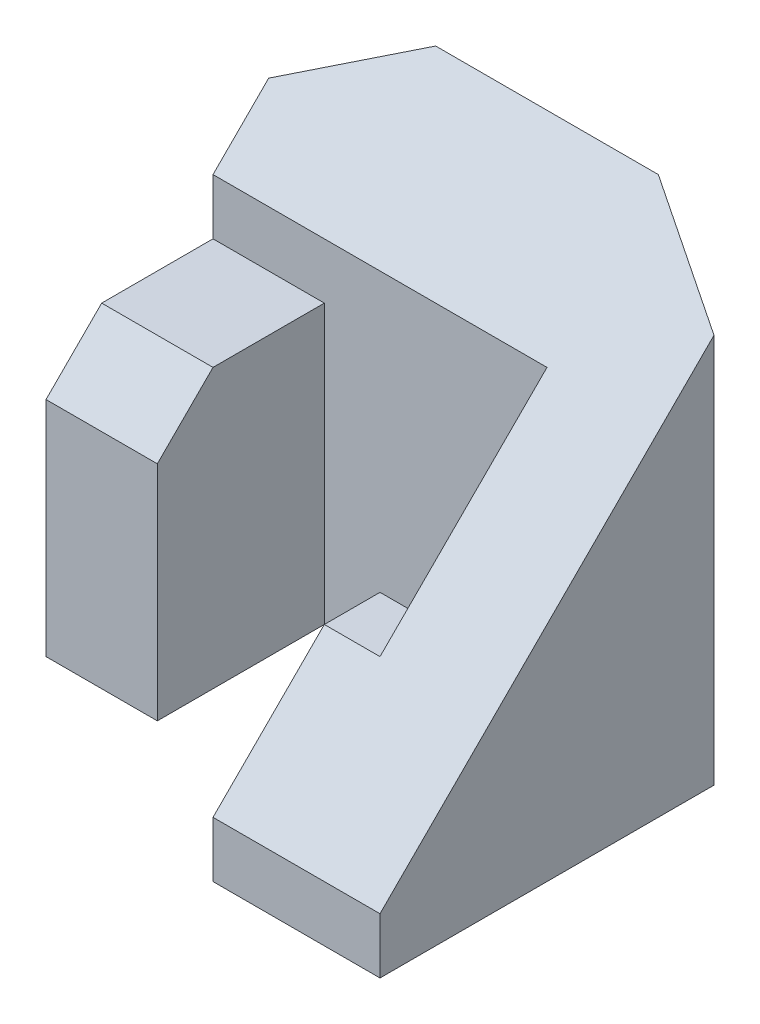
ISO-10303-21;
HEADER;
FILE_DESCRIPTION(('STEP AP214'),'2;1');
FILE_NAME('part.step','',(''),(''),'','','');
FILE_SCHEMA(('AUTOMOTIVE_DESIGN { 1 0 10303 214 1 1 1 1 }'));
ENDSEC;
DATA;
#1=APPLICATION_CONTEXT('core data for automotive mechanical design processes');
#2=APPLICATION_PROTOCOL_DEFINITION('international standard','automotive_design',2000,#1);
#3=PRODUCT_CONTEXT('',#1,'mechanical');
#4=PRODUCT('Part','Part','',(#3));
#5=PRODUCT_RELATED_PRODUCT_CATEGORY('part','',(#4));
#6=PRODUCT_DEFINITION_FORMATION('','',#4);
#7=PRODUCT_DEFINITION_CONTEXT('part definition',#1,'design');
#8=PRODUCT_DEFINITION('design','',#6,#7);
#9=PRODUCT_DEFINITION_SHAPE('','',#8);
#10=(LENGTH_UNIT() NAMED_UNIT(*) SI_UNIT(.MILLI.,.METRE.));
#11=(NAMED_UNIT(*) PLANE_ANGLE_UNIT() SI_UNIT($,.RADIAN.));
#12=(NAMED_UNIT(*) SI_UNIT($,.STERADIAN.) SOLID_ANGLE_UNIT());
#13=UNCERTAINTY_MEASURE_WITH_UNIT(LENGTH_MEASURE(1.E-05),#10,'distance_accuracy_value','');
#14=(GEOMETRIC_REPRESENTATION_CONTEXT(3) GLOBAL_UNCERTAINTY_ASSIGNED_CONTEXT((#13)) GLOBAL_UNIT_ASSIGNED_CONTEXT((#10,
#11,#12)) REPRESENTATION_CONTEXT('',''));
#15=CARTESIAN_POINT('',(0.,0.,0.));
#16=DIRECTION('',(0.,0.,1.));
#17=DIRECTION('',(1.,0.,0.));
#18=AXIS2_PLACEMENT_3D('',#15,#16,#17);
#19=CARTESIAN_POINT('',(-20.,-20.,10.));
#20=DIRECTION('',(0.,0.,-1.));
#21=DIRECTION('',(-1.,0.,0.));
#22=AXIS2_PLACEMENT_3D('',#19,#20,#21);
#23=PLANE('',#22);
#24=DIRECTION('',(0.,1.,0.));
#25=VECTOR('',#24,1.);
#26=CARTESIAN_POINT('',(-9.99999999999999,-20.,10.));
#27=LINE('',#26,#25);
#28=CARTESIAN_POINT('',(-9.99999999999999,-20.,10.));
#29=VERTEX_POINT('',#28);
#30=CARTESIAN_POINT('',(-9.99999999999999,4.99999999999999,10.));
#31=VERTEX_POINT('',#30);
#32=EDGE_CURVE('E239',#29,#31,#27,.T.);
#33=ORIENTED_EDGE('',*,*,#32,.F.);
#34=DIRECTION('',(-1.,0.,0.));
#35=VECTOR('',#34,1.);
#36=CARTESIAN_POINT('',(-20.,-20.,10.));
#37=LINE('',#36,#35);
#38=CARTESIAN_POINT('',(10.,-20.,10.));
#39=VERTEX_POINT('',#38);
#40=EDGE_CURVE('E209',#39,#29,#37,.T.);
#41=ORIENTED_EDGE('',*,*,#40,.F.);
#42=DIRECTION('',(0.,1.,0.));
#43=VECTOR('',#42,1.);
#44=CARTESIAN_POINT('',(10.,-20.,10.));
#45=LINE('',#44,#43);
#46=CARTESIAN_POINT('',(10.,9.99999999999999,10.));
#47=VERTEX_POINT('',#46);
#48=EDGE_CURVE('E158',#39,#47,#45,.T.);
#49=ORIENTED_EDGE('',*,*,#48,.T.);
#50=DIRECTION('',(1.,0.,0.));
#51=VECTOR('',#50,1.);
#52=CARTESIAN_POINT('',(-20.,9.99999999999999,10.));
#53=LINE('',#52,#51);
#54=CARTESIAN_POINT('',(-20.,9.99999999999999,10.));
#55=VERTEX_POINT('',#54);
#56=EDGE_CURVE('E198',#55,#47,#53,.T.);
#57=ORIENTED_EDGE('',*,*,#56,.F.);
#58=DIRECTION('',(0.,1.,0.));
#59=VECTOR('',#58,1.);
#60=CARTESIAN_POINT('',(-20.,-20.,10.));
#61=LINE('',#60,#59);
#62=CARTESIAN_POINT('',(-20.,4.99999999999999,10.));
#63=VERTEX_POINT('',#62);
#64=EDGE_CURVE('E154',#63,#55,#61,.T.);
#65=ORIENTED_EDGE('',*,*,#64,.F.);
#66=DIRECTION('',(-1.,0.,0.));
#67=VECTOR('',#66,1.);
#68=CARTESIAN_POINT('',(-9.99999999999999,4.99999999999999,10.));
#69=LINE('',#68,#67);
#70=EDGE_CURVE('E243',#31,#63,#69,.T.);
#71=ORIENTED_EDGE('',*,*,#70,.F.);
#72=EDGE_LOOP('',(#33,#41,#49,#57,#65,#71));
#73=FACE_BOUND('',#72,.T.);
#74=ADVANCED_FACE('F32',(#73),#23,.F.);
#75=CARTESIAN_POINT('',(20.,20.,35.));
#76=DIRECTION('',(-1.,0.,0.));
#77=DIRECTION('',(0.,0.,1.));
#78=AXIS2_PLACEMENT_3D('',#75,#76,#77);
#79=PLANE('',#78);
#80=DIRECTION('',(0.,0.,-1.));
#81=VECTOR('',#80,1.);
#82=CARTESIAN_POINT('',(20.,-20.,35.));
#83=LINE('',#82,#81);
#84=CARTESIAN_POINT('',(20.,-20.,35.));
#85=VERTEX_POINT('',#84);
#86=CARTESIAN_POINT('',(20.,-20.,5.));
#87=VERTEX_POINT('',#86);
#88=EDGE_CURVE('E164',#85,#87,#83,.T.);
#89=ORIENTED_EDGE('',*,*,#88,.T.);
#90=DIRECTION('',(0.,-1.,0.));
#91=VECTOR('',#90,1.);
#92=CARTESIAN_POINT('',(20.,20.,5.));
#93=LINE('',#92,#91);
#94=CARTESIAN_POINT('',(20.,15.,5.));
#95=VERTEX_POINT('',#94);
#96=EDGE_CURVE('E175',#95,#87,#93,.T.);
#97=ORIENTED_EDGE('',*,*,#96,.F.);
#98=DIRECTION('',(0.,0.707106781186548,-0.707106781186548));
#99=VECTOR('',#98,1.);
#100=CARTESIAN_POINT('',(20.,20.,0.));
#101=LINE('',#100,#99);
#102=CARTESIAN_POINT('',(20.,-15.,35.));
#103=VERTEX_POINT('',#102);
#104=EDGE_CURVE('E180',#103,#95,#101,.T.);
#105=ORIENTED_EDGE('',*,*,#104,.F.);
#106=DIRECTION('',(0.,1.,0.));
#107=VECTOR('',#106,1.);
#108=CARTESIAN_POINT('',(20.,20.,35.));
#109=LINE('',#108,#107);
#110=EDGE_CURVE('E156',#85,#103,#109,.T.);
#111=ORIENTED_EDGE('',*,*,#110,.F.);
#112=EDGE_LOOP('',(#89,#97,#105,#111));
#113=FACE_BOUND('',#112,.T.);
#114=ADVANCED_FACE('F34',(#113),#79,.F.);
#115=CARTESIAN_POINT('',(-20.,20.,35.));
#116=DIRECTION('',(1.,0.,0.));
#117=DIRECTION('',(0.,0.,-1.));
#118=AXIS2_PLACEMENT_3D('',#115,#116,#117);
#119=PLANE('',#118);
#120=DIRECTION('',(0.,0.707106781186548,-0.707106781186548));
#121=VECTOR('',#120,1.);
#122=CARTESIAN_POINT('',(-20.,20.,0.));
#123=LINE('',#122,#121);
#124=CARTESIAN_POINT('',(-20.,15.,4.99999999999999));
#125=VERTEX_POINT('',#124);
#126=EDGE_CURVE('E187',#55,#125,#123,.T.);
#127=ORIENTED_EDGE('',*,*,#126,.T.);
#128=DIRECTION('',(0.,-1.,0.));
#129=VECTOR('',#128,1.);
#130=CARTESIAN_POINT('',(-20.,20.,5.));
#131=LINE('',#130,#129);
#132=CARTESIAN_POINT('',(-20.,-20.,5.));
#133=VERTEX_POINT('',#132);
#134=EDGE_CURVE('E46',#125,#133,#131,.T.);
#135=ORIENTED_EDGE('',*,*,#134,.T.);
#136=DIRECTION('',(0.,0.,-1.));
#137=VECTOR('',#136,1.);
#138=CARTESIAN_POINT('',(-20.,-20.,35.));
#139=LINE('',#138,#137);
#140=CARTESIAN_POINT('',(-20.,-20.,25.));
#141=VERTEX_POINT('',#140);
#142=EDGE_CURVE('E167',#141,#133,#139,.T.);
#143=ORIENTED_EDGE('',*,*,#142,.F.);
#144=DIRECTION('',(0.,-1.,0.));
#145=VECTOR('',#144,1.);
#146=CARTESIAN_POINT('',(-20.,4.99999999999999,25.));
#147=LINE('',#146,#145);
#148=CARTESIAN_POINT('',(-20.,0.,25.));
#149=VERTEX_POINT('',#148);
#150=EDGE_CURVE('E240',#149,#141,#147,.T.);
#151=ORIENTED_EDGE('',*,*,#150,.F.);
#152=DIRECTION('',(0.,-0.707106781186547,0.707106781186548));
#153=VECTOR('',#152,1.);
#154=CARTESIAN_POINT('',(-20.,4.99999999999999,20.));
#155=LINE('',#154,#153);
#156=CARTESIAN_POINT('',(-20.,4.99999999999999,20.));
#157=VERTEX_POINT('',#156);
#158=EDGE_CURVE('E231',#157,#149,#155,.T.);
#159=ORIENTED_EDGE('',*,*,#158,.F.);
#160=DIRECTION('',(0.,0.,-1.));
#161=VECTOR('',#160,1.);
#162=CARTESIAN_POINT('',(-20.,4.99999999999999,25.));
#163=LINE('',#162,#161);
#164=EDGE_CURVE('E248',#157,#63,#163,.T.);
#165=ORIENTED_EDGE('',*,*,#164,.T.);
#166=ORIENTED_EDGE('',*,*,#64,.T.);
#167=EDGE_LOOP('',(#127,#135,#143,#151,#159,#165,#166));
#168=FACE_BOUND('',#167,.T.);
#169=ADVANCED_FACE('F297',(#168),#119,.F.);
#170=CARTESIAN_POINT('',(0.,0.,35.));
#171=DIRECTION('',(0.,0.,1.));
#172=DIRECTION('',(1.,0.,0.));
#173=AXIS2_PLACEMENT_3D('',#170,#171,#172);
#174=PLANE('',#173);
#175=ORIENTED_EDGE('',*,*,#110,.T.);
#176=DIRECTION('',(-1.,0.,0.));
#177=VECTOR('',#176,1.);
#178=CARTESIAN_POINT('',(20.,-15.,35.));
#179=LINE('',#178,#177);
#180=CARTESIAN_POINT('',(5.00000000000001,-15.,35.));
#181=VERTEX_POINT('',#180);
#182=EDGE_CURVE('E186',#103,#181,#179,.T.);
#183=ORIENTED_EDGE('',*,*,#182,.T.);
#184=DIRECTION('',(0.,1.,0.));
#185=VECTOR('',#184,1.);
#186=CARTESIAN_POINT('',(5.00000000000001,-20.,35.));
#187=LINE('',#186,#185);
#188=CARTESIAN_POINT('',(5.00000000000001,-20.,35.));
#189=VERTEX_POINT('',#188);
#190=EDGE_CURVE('E211',#189,#181,#187,.T.);
#191=ORIENTED_EDGE('',*,*,#190,.F.);
#192=DIRECTION('',(1.,0.,0.));
#193=VECTOR('',#192,1.);
#194=CARTESIAN_POINT('',(-20.,-20.,35.));
#195=LINE('',#194,#193);
#196=EDGE_CURVE('E161',#189,#85,#195,.T.);
#197=ORIENTED_EDGE('',*,*,#196,.T.);
#198=EDGE_LOOP('',(#175,#183,#191,#197));
#199=FACE_BOUND('',#198,.T.);
#200=ADVANCED_FACE('F225',(#199),#174,.T.);
#201=CARTESIAN_POINT('',(10.,-20.,10.));
#202=DIRECTION('',(1.,0.,0.));
#203=DIRECTION('',(0.,0.,-1.));
#204=AXIS2_PLACEMENT_3D('',#201,#202,#203);
#205=PLANE('',#204);
#206=DIRECTION('',(0.,-0.707106781186548,0.707106781186548));
#207=VECTOR('',#206,1.);
#208=CARTESIAN_POINT('',(10.,-5.,25.));
#209=LINE('',#208,#207);
#210=CARTESIAN_POINT('',(10.,-5.00000000000001,25.));
#211=VERTEX_POINT('',#210);
#212=EDGE_CURVE('E189',#47,#211,#209,.T.);
#213=ORIENTED_EDGE('',*,*,#212,.F.);
#214=ORIENTED_EDGE('',*,*,#48,.F.);
#215=DIRECTION('',(0.,0.,-1.));
#216=VECTOR('',#215,1.);
#217=CARTESIAN_POINT('',(10.,-20.,10.));
#218=LINE('',#217,#216);
#219=CARTESIAN_POINT('',(10.,-20.,20.));
#220=VERTEX_POINT('',#219);
#221=EDGE_CURVE('E206',#220,#39,#218,.T.);
#222=ORIENTED_EDGE('',*,*,#221,.F.);
#223=DIRECTION('',(0.,1.,0.));
#224=VECTOR('',#223,1.);
#225=CARTESIAN_POINT('',(10.,-20.,20.));
#226=LINE('',#225,#224);
#227=CARTESIAN_POINT('',(10.,-5.00000000000001,20.));
#228=VERTEX_POINT('',#227);
#229=EDGE_CURVE('E215',#220,#228,#226,.T.);
#230=ORIENTED_EDGE('',*,*,#229,.T.);
#231=DIRECTION('',(0.,0.,1.));
#232=VECTOR('',#231,1.);
#233=CARTESIAN_POINT('',(10.,-5.00000000000001,20.));
#234=LINE('',#233,#232);
#235=EDGE_CURVE('E259',#228,#211,#234,.T.);
#236=ORIENTED_EDGE('',*,*,#235,.T.);
#237=EDGE_LOOP('',(#213,#214,#222,#230,#236));
#238=FACE_BOUND('',#237,.T.);
#239=ADVANCED_FACE('F279',(#238),#205,.F.);
#240=CARTESIAN_POINT('',(10.,-20.,20.));
#241=DIRECTION('',(0.,0.,1.));
#242=DIRECTION('',(1.,0.,0.));
#243=AXIS2_PLACEMENT_3D('',#240,#241,#242);
#244=PLANE('',#243);
#245=DIRECTION('',(0.,1.,0.));
#246=VECTOR('',#245,1.);
#247=CARTESIAN_POINT('',(5.00000000000001,-20.,20.));
#248=LINE('',#247,#246);
#249=CARTESIAN_POINT('',(5.00000000000001,-20.,20.));
#250=VERTEX_POINT('',#249);
#251=CARTESIAN_POINT('',(5.00000000000001,-5.00000000000001,20.));
#252=VERTEX_POINT('',#251);
#253=EDGE_CURVE('E218',#250,#252,#248,.T.);
#254=ORIENTED_EDGE('',*,*,#253,.T.);
#255=DIRECTION('',(-1.,0.,0.));
#256=VECTOR('',#255,1.);
#257=CARTESIAN_POINT('',(10.,-5.00000000000001,20.));
#258=LINE('',#257,#256);
#259=EDGE_CURVE('E194',#228,#252,#258,.T.);
#260=ORIENTED_EDGE('',*,*,#259,.F.);
#261=ORIENTED_EDGE('',*,*,#229,.F.);
#262=DIRECTION('',(1.,0.,0.));
#263=VECTOR('',#262,1.);
#264=CARTESIAN_POINT('',(10.,-20.,20.));
#265=LINE('',#264,#263);
#266=EDGE_CURVE('E203',#250,#220,#265,.T.);
#267=ORIENTED_EDGE('',*,*,#266,.F.);
#268=EDGE_LOOP('',(#254,#260,#261,#267));
#269=FACE_BOUND('',#268,.T.);
#270=ADVANCED_FACE('F273',(#269),#244,.F.);
#271=CARTESIAN_POINT('',(5.00000000000001,-20.,20.));
#272=DIRECTION('',(1.,0.,0.));
#273=DIRECTION('',(0.,0.,-1.));
#274=AXIS2_PLACEMENT_3D('',#271,#272,#273);
#275=PLANE('',#274);
#276=DIRECTION('',(0.,-0.707106781186548,0.707106781186548));
#277=VECTOR('',#276,1.);
#278=CARTESIAN_POINT('',(5.00000000000001,-10.,30.));
#279=LINE('',#278,#277);
#280=CARTESIAN_POINT('',(5.00000000000001,-5.00000000000001,25.));
#281=VERTEX_POINT('',#280);
#282=EDGE_CURVE('E170',#281,#181,#279,.T.);
#283=ORIENTED_EDGE('',*,*,#282,.F.);
#284=DIRECTION('',(0.,0.,1.));
#285=VECTOR('',#284,1.);
#286=CARTESIAN_POINT('',(5.00000000000001,-5.00000000000001,20.));
#287=LINE('',#286,#285);
#288=EDGE_CURVE('E258',#252,#281,#287,.T.);
#289=ORIENTED_EDGE('',*,*,#288,.F.);
#290=ORIENTED_EDGE('',*,*,#253,.F.);
#291=DIRECTION('',(0.,0.,-1.));
#292=VECTOR('',#291,1.);
#293=CARTESIAN_POINT('',(5.00000000000001,-20.,20.));
#294=LINE('',#293,#292);
#295=EDGE_CURVE('E200',#189,#250,#294,.T.);
#296=ORIENTED_EDGE('',*,*,#295,.F.);
#297=ORIENTED_EDGE('',*,*,#190,.T.);
#298=EDGE_LOOP('',(#283,#289,#290,#296,#297));
#299=FACE_BOUND('',#298,.T.);
#300=ADVANCED_FACE('F271',(#299),#275,.F.);
#301=CARTESIAN_POINT('',(-20.,-20.,35.));
#302=DIRECTION('',(0.,1.,0.));
#303=DIRECTION('',(0.,0.,1.));
#304=AXIS2_PLACEMENT_3D('',#301,#302,#303);
#305=PLANE('',#304);
#306=ORIENTED_EDGE('',*,*,#142,.T.);
#307=DIRECTION('',(-0.894427190999916,0.,0.447213595499958));
#308=VECTOR('',#307,1.);
#309=CARTESIAN_POINT('',(-9.99999999999999,-20.,0.));
#310=LINE('',#309,#308);
#311=CARTESIAN_POINT('',(-9.99999999999999,-20.,0.));
#312=VERTEX_POINT('',#311);
#313=EDGE_CURVE('E150',#312,#133,#310,.T.);
#314=ORIENTED_EDGE('',*,*,#313,.F.);
#315=DIRECTION('',(1.,0.,0.));
#316=VECTOR('',#315,1.);
#317=CARTESIAN_POINT('',(-20.,-20.,0.));
#318=LINE('',#317,#316);
#319=CARTESIAN_POINT('',(10.,-20.,0.));
#320=VERTEX_POINT('',#319);
#321=EDGE_CURVE('E149',#312,#320,#318,.T.);
#322=ORIENTED_EDGE('',*,*,#321,.T.);
#323=DIRECTION('',(-0.894427190999916,0.,-0.447213595499958));
#324=VECTOR('',#323,1.);
#325=CARTESIAN_POINT('',(10.,-20.,0.));
#326=LINE('',#325,#324);
#327=EDGE_CURVE('E183',#87,#320,#326,.T.);
#328=ORIENTED_EDGE('',*,*,#327,.F.);
#329=ORIENTED_EDGE('',*,*,#88,.F.);
#330=ORIENTED_EDGE('',*,*,#196,.F.);
#331=ORIENTED_EDGE('',*,*,#295,.T.);
#332=ORIENTED_EDGE('',*,*,#266,.T.);
#333=ORIENTED_EDGE('',*,*,#221,.T.);
#334=ORIENTED_EDGE('',*,*,#40,.T.);
#335=DIRECTION('',(0.,0.,-1.));
#336=VECTOR('',#335,1.);
#337=CARTESIAN_POINT('',(-9.99999999999999,-20.,25.));
#338=LINE('',#337,#336);
#339=CARTESIAN_POINT('',(-9.99999999999999,-20.,25.));
#340=VERTEX_POINT('',#339);
#341=EDGE_CURVE('E256',#340,#29,#338,.T.);
#342=ORIENTED_EDGE('',*,*,#341,.F.);
#343=DIRECTION('',(1.,0.,0.));
#344=VECTOR('',#343,1.);
#345=CARTESIAN_POINT('',(-20.,-20.,25.));
#346=LINE('',#345,#344);
#347=EDGE_CURVE('E242',#141,#340,#346,.T.);
#348=ORIENTED_EDGE('',*,*,#347,.F.);
#349=EDGE_LOOP('',(#306,#314,#322,#328,#329,#330,#331,#332,#333,#334,#342,#348));
#350=FACE_BOUND('',#349,.T.);
#351=ADVANCED_FACE('F227',(#350),#305,.F.);
#352=CARTESIAN_POINT('',(0.,0.,0.));
#353=DIRECTION('',(0.,0.,1.));
#354=DIRECTION('',(1.,0.,0.));
#355=AXIS2_PLACEMENT_3D('',#352,#353,#354);
#356=PLANE('',#355);
#357=ORIENTED_EDGE('',*,*,#321,.F.);
#358=DIRECTION('',(0.,-1.,0.));
#359=VECTOR('',#358,1.);
#360=CARTESIAN_POINT('',(-9.99999999999999,20.,0.));
#361=LINE('',#360,#359);
#362=CARTESIAN_POINT('',(-9.99999999999999,20.,0.));
#363=VERTEX_POINT('',#362);
#364=EDGE_CURVE('E138',#363,#312,#361,.T.);
#365=ORIENTED_EDGE('',*,*,#364,.F.);
#366=DIRECTION('',(-1.,0.,0.));
#367=VECTOR('',#366,1.);
#368=CARTESIAN_POINT('',(-20.,20.,0.));
#369=LINE('',#368,#367);
#370=CARTESIAN_POINT('',(10.,20.,0.));
#371=VERTEX_POINT('',#370);
#372=EDGE_CURVE('E148',#371,#363,#369,.T.);
#373=ORIENTED_EDGE('',*,*,#372,.F.);
#374=DIRECTION('',(0.,-1.,0.));
#375=VECTOR('',#374,1.);
#376=CARTESIAN_POINT('',(10.,20.,0.));
#377=LINE('',#376,#375);
#378=EDGE_CURVE('E54',#371,#320,#377,.T.);
#379=ORIENTED_EDGE('',*,*,#378,.T.);
#380=EDGE_LOOP('',(#357,#365,#373,#379));
#381=FACE_BOUND('',#380,.T.);
#382=ADVANCED_FACE('F147',(#381),#356,.F.);
#383=CARTESIAN_POINT('',(20.,20.,0.));
#384=DIRECTION('',(0.,0.707106781186548,0.707106781186548));
#385=DIRECTION('',(0.,-0.707106781186548,0.707106781186548));
#386=AXIS2_PLACEMENT_3D('',#383,#384,#385);
#387=PLANE('',#386);
#388=DIRECTION('',(0.816496580927726,0.408248290463863,-0.408248290463863));
#389=VECTOR('',#388,1.);
#390=CARTESIAN_POINT('',(10.,30.,-10.));
#391=LINE('',#390,#389);
#392=EDGE_CURVE('E11',#125,#363,#391,.T.);
#393=ORIENTED_EDGE('',*,*,#392,.F.);
#394=ORIENTED_EDGE('',*,*,#126,.F.);
#395=ORIENTED_EDGE('',*,*,#56,.T.);
#396=ORIENTED_EDGE('',*,*,#212,.T.);
#397=DIRECTION('',(-1.,0.,0.));
#398=VECTOR('',#397,1.);
#399=CARTESIAN_POINT('',(10.,-5.00000000000001,25.));
#400=LINE('',#399,#398);
#401=EDGE_CURVE('E191',#211,#281,#400,.T.);
#402=ORIENTED_EDGE('',*,*,#401,.T.);
#403=ORIENTED_EDGE('',*,*,#282,.T.);
#404=ORIENTED_EDGE('',*,*,#182,.F.);
#405=ORIENTED_EDGE('',*,*,#104,.T.);
#406=DIRECTION('',(0.816496580927726,-0.408248290463863,0.408248290463863));
#407=VECTOR('',#406,1.);
#408=CARTESIAN_POINT('',(16.6666666666667,16.6666666666667,3.33333333333333));
#409=LINE('',#408,#407);
#410=EDGE_CURVE('E40',#371,#95,#409,.T.);
#411=ORIENTED_EDGE('',*,*,#410,.F.);
#412=ORIENTED_EDGE('',*,*,#372,.T.);
#413=EDGE_LOOP('',(#393,#394,#395,#396,#402,#403,#404,#405,#411,#412));
#414=FACE_BOUND('',#413,.T.);
#415=ADVANCED_FACE('F152',(#414),#387,.T.);
#416=CARTESIAN_POINT('',(10.,-5.00000000000001,20.));
#417=DIRECTION('',(0.,-1.,0.));
#418=DIRECTION('',(0.,0.,-1.));
#419=AXIS2_PLACEMENT_3D('',#416,#417,#418);
#420=PLANE('',#419);
#421=ORIENTED_EDGE('',*,*,#288,.T.);
#422=ORIENTED_EDGE('',*,*,#401,.F.);
#423=ORIENTED_EDGE('',*,*,#235,.F.);
#424=ORIENTED_EDGE('',*,*,#259,.T.);
#425=EDGE_LOOP('',(#421,#422,#423,#424));
#426=FACE_BOUND('',#425,.T.);
#427=ADVANCED_FACE('F268',(#426),#420,.F.);
#428=CARTESIAN_POINT('',(-9.99999999999999,-20.,25.));
#429=DIRECTION('',(-1.,0.,0.));
#430=DIRECTION('',(0.,0.,1.));
#431=AXIS2_PLACEMENT_3D('',#428,#429,#430);
#432=PLANE('',#431);
#433=DIRECTION('',(0.,0.,-1.));
#434=VECTOR('',#433,1.);
#435=CARTESIAN_POINT('',(-9.99999999999999,4.99999999999999,25.));
#436=LINE('',#435,#434);
#437=CARTESIAN_POINT('',(-9.99999999999999,4.99999999999999,20.));
#438=VERTEX_POINT('',#437);
#439=EDGE_CURVE('E254',#438,#31,#436,.T.);
#440=ORIENTED_EDGE('',*,*,#439,.F.);
#441=DIRECTION('',(0.,-0.707106781186547,0.707106781186548));
#442=VECTOR('',#441,1.);
#443=CARTESIAN_POINT('',(-9.99999999999999,-10.,35.));
#444=LINE('',#443,#442);
#445=CARTESIAN_POINT('',(-9.99999999999999,0.,25.));
#446=VERTEX_POINT('',#445);
#447=EDGE_CURVE('E236',#438,#446,#444,.T.);
#448=ORIENTED_EDGE('',*,*,#447,.T.);
#449=DIRECTION('',(0.,1.,0.));
#450=VECTOR('',#449,1.);
#451=CARTESIAN_POINT('',(-9.99999999999999,-20.,25.));
#452=LINE('',#451,#450);
#453=EDGE_CURVE('E245',#340,#446,#452,.T.);
#454=ORIENTED_EDGE('',*,*,#453,.F.);
#455=ORIENTED_EDGE('',*,*,#341,.T.);
#456=ORIENTED_EDGE('',*,*,#32,.T.);
#457=EDGE_LOOP('',(#440,#448,#454,#455,#456));
#458=FACE_BOUND('',#457,.T.);
#459=ADVANCED_FACE('F287',(#458),#432,.F.);
#460=CARTESIAN_POINT('',(-9.99999999999999,4.99999999999999,25.));
#461=DIRECTION('',(0.,-1.,0.));
#462=DIRECTION('',(0.,0.,-1.));
#463=AXIS2_PLACEMENT_3D('',#460,#461,#462);
#464=PLANE('',#463);
#465=ORIENTED_EDGE('',*,*,#164,.F.);
#466=DIRECTION('',(-1.,0.,0.));
#467=VECTOR('',#466,1.);
#468=CARTESIAN_POINT('',(-4.99999999999999,4.99999999999999,20.));
#469=LINE('',#468,#467);
#470=EDGE_CURVE('E234',#438,#157,#469,.T.);
#471=ORIENTED_EDGE('',*,*,#470,.F.);
#472=ORIENTED_EDGE('',*,*,#439,.T.);
#473=ORIENTED_EDGE('',*,*,#70,.T.);
#474=EDGE_LOOP('',(#465,#471,#472,#473));
#475=FACE_BOUND('',#474,.T.);
#476=ADVANCED_FACE('F301',(#475),#464,.F.);
#477=CARTESIAN_POINT('',(0.,0.,25.));
#478=DIRECTION('',(0.,0.,1.));
#479=DIRECTION('',(1.,0.,0.));
#480=AXIS2_PLACEMENT_3D('',#477,#478,#479);
#481=PLANE('',#480);
#482=DIRECTION('',(1.,0.,0.));
#483=VECTOR('',#482,1.);
#484=CARTESIAN_POINT('',(0.,0.,25.));
#485=LINE('',#484,#483);
#486=EDGE_CURVE('E172',#149,#446,#485,.T.);
#487=ORIENTED_EDGE('',*,*,#486,.F.);
#488=ORIENTED_EDGE('',*,*,#150,.T.);
#489=ORIENTED_EDGE('',*,*,#347,.T.);
#490=ORIENTED_EDGE('',*,*,#453,.T.);
#491=EDGE_LOOP('',(#487,#488,#489,#490));
#492=FACE_BOUND('',#491,.T.);
#493=ADVANCED_FACE('F293',(#492),#481,.T.);
#494=CARTESIAN_POINT('',(-4.99999999999999,4.99999999999999,20.));
#495=DIRECTION('',(0.,-0.707106781186548,-0.707106781186547));
#496=DIRECTION('',(0.,0.707106781186547,-0.707106781186548));
#497=AXIS2_PLACEMENT_3D('',#494,#495,#496);
#498=PLANE('',#497);
#499=ORIENTED_EDGE('',*,*,#470,.T.);
#500=ORIENTED_EDGE('',*,*,#158,.T.);
#501=ORIENTED_EDGE('',*,*,#486,.T.);
#502=ORIENTED_EDGE('',*,*,#447,.F.);
#503=EDGE_LOOP('',(#499,#500,#501,#502));
#504=FACE_BOUND('',#503,.T.);
#505=ADVANCED_FACE('F303',(#504),#498,.F.);
#506=CARTESIAN_POINT('',(10.,20.,0.));
#507=DIRECTION('',(-0.447213595499958,0.,0.894427190999916));
#508=DIRECTION('',(0.894427190999916,0.,0.447213595499958));
#509=AXIS2_PLACEMENT_3D('',#506,#507,#508);
#510=PLANE('',#509);
#511=ORIENTED_EDGE('',*,*,#410,.T.);
#512=ORIENTED_EDGE('',*,*,#96,.T.);
#513=ORIENTED_EDGE('',*,*,#327,.T.);
#514=ORIENTED_EDGE('',*,*,#378,.F.);
#515=EDGE_LOOP('',(#511,#512,#513,#514));
#516=FACE_BOUND('',#515,.T.);
#517=ADVANCED_FACE('F174',(#516),#510,.F.);
#518=CARTESIAN_POINT('',(-9.99999999999999,20.,0.));
#519=DIRECTION('',(0.447213595499958,0.,0.894427190999916));
#520=DIRECTION('',(0.894427190999916,0.,-0.447213595499958));
#521=AXIS2_PLACEMENT_3D('',#518,#519,#520);
#522=PLANE('',#521);
#523=ORIENTED_EDGE('',*,*,#392,.T.);
#524=ORIENTED_EDGE('',*,*,#364,.T.);
#525=ORIENTED_EDGE('',*,*,#313,.T.);
#526=ORIENTED_EDGE('',*,*,#134,.F.);
#527=EDGE_LOOP('',(#523,#524,#525,#526));
#528=FACE_BOUND('',#527,.T.);
#529=ADVANCED_FACE('F137',(#528),#522,.F.);
#530=CLOSED_SHELL('',(#74,#114,#169,#200,#239,#270,#300,#351,#382,#415,#427,#459,#476,#493,#505,
#517,#529));
#531=MANIFOLD_SOLID_BREP('B2',#530);
#532=ADVANCED_BREP_SHAPE_REPRESENTATION('',(#18,#531),#14);
#533=SHAPE_DEFINITION_REPRESENTATION(#9,#532);
ENDSEC;
END-ISO-10303-21;
